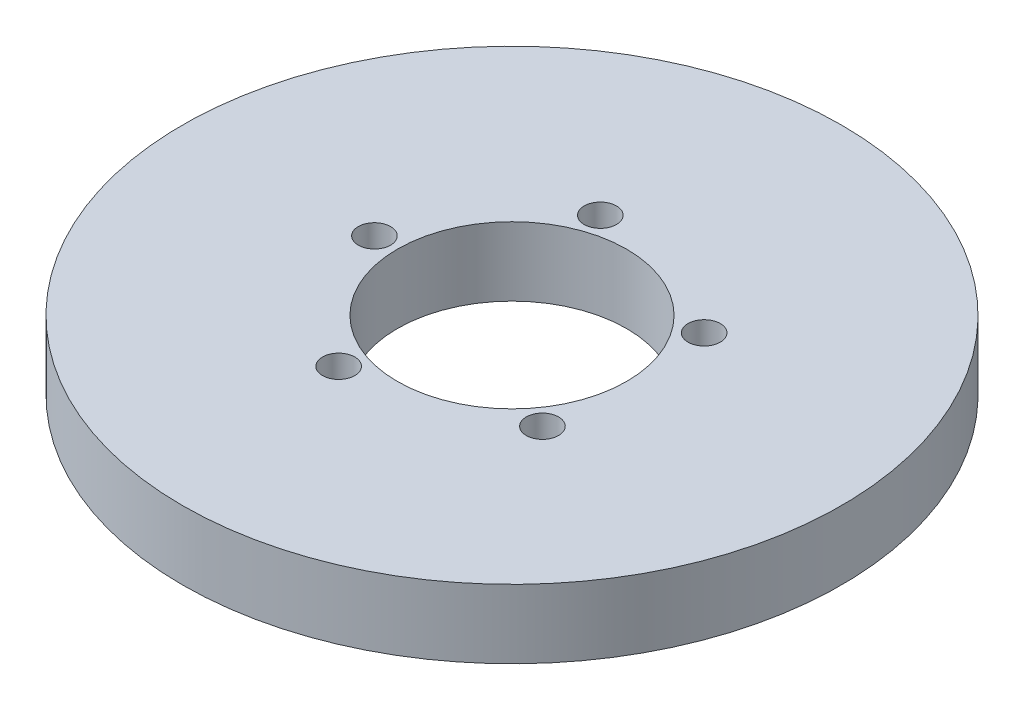
ISO-10303-21;
HEADER;
FILE_DESCRIPTION(('STEP AP214'),'2;1');
FILE_NAME('part.step','',(''),(''),'','','');
FILE_SCHEMA(('AUTOMOTIVE_DESIGN { 1 0 10303 214 1 1 1 1 }'));
ENDSEC;
DATA;
#1=APPLICATION_CONTEXT('core data for automotive mechanical design processes');
#2=APPLICATION_PROTOCOL_DEFINITION('international standard','automotive_design',2000,#1);
#3=PRODUCT_CONTEXT('',#1,'mechanical');
#4=PRODUCT('Part','Part','',(#3));
#5=PRODUCT_RELATED_PRODUCT_CATEGORY('part','',(#4));
#6=PRODUCT_DEFINITION_FORMATION('','',#4);
#7=PRODUCT_DEFINITION_CONTEXT('part definition',#1,'design');
#8=PRODUCT_DEFINITION('design','',#6,#7);
#9=PRODUCT_DEFINITION_SHAPE('','',#8);
#10=(LENGTH_UNIT() NAMED_UNIT(*) SI_UNIT(.MILLI.,.METRE.));
#11=(NAMED_UNIT(*) PLANE_ANGLE_UNIT() SI_UNIT($,.RADIAN.));
#12=(NAMED_UNIT(*) SI_UNIT($,.STERADIAN.) SOLID_ANGLE_UNIT());
#13=UNCERTAINTY_MEASURE_WITH_UNIT(LENGTH_MEASURE(1.E-05),#10,'distance_accuracy_value','');
#14=(GEOMETRIC_REPRESENTATION_CONTEXT(3) GLOBAL_UNCERTAINTY_ASSIGNED_CONTEXT((#13)) GLOBAL_UNIT_ASSIGNED_CONTEXT((#10,
#11,#12)) REPRESENTATION_CONTEXT('',''));
#15=CARTESIAN_POINT('',(0.,0.,0.));
#16=DIRECTION('',(0.,0.,1.));
#17=DIRECTION('',(1.,0.,0.));
#18=AXIS2_PLACEMENT_3D('',#15,#16,#17);
#19=CARTESIAN_POINT('',(0.,12.,0.));
#20=DIRECTION('',(0.,-1.,0.));
#21=DIRECTION('',(0.,0.,-1.));
#22=AXIS2_PLACEMENT_3D('',#19,#20,#21);
#23=CYLINDRICAL_SURFACE('',#22,57.5);
#24=CARTESIAN_POINT('',(0.,12.,0.));
#25=DIRECTION('',(0.,1.,0.));
#26=DIRECTION('',(0.,0.,1.));
#27=AXIS2_PLACEMENT_3D('',#24,#25,#26);
#28=CIRCLE('',#27,57.5);
#29=CARTESIAN_POINT('',(0.,12.,57.5));
#30=VERTEX_POINT('',#29);
#31=EDGE_CURVE('E10',#30,#30,#28,.T.);
#32=ORIENTED_EDGE('',*,*,#31,.F.);
#33=EDGE_LOOP('',(#32));
#34=FACE_BOUND('',#33,.T.);
#35=CARTESIAN_POINT('',(0.,0.,0.));
#36=DIRECTION('',(0.,1.,0.));
#37=DIRECTION('',(0.,0.,1.));
#38=AXIS2_PLACEMENT_3D('',#35,#36,#37);
#39=CIRCLE('',#38,57.5);
#40=CARTESIAN_POINT('',(0.,0.,57.5));
#41=VERTEX_POINT('',#40);
#42=EDGE_CURVE('E37',#41,#41,#39,.T.);
#43=ORIENTED_EDGE('',*,*,#42,.T.);
#44=EDGE_LOOP('',(#43));
#45=FACE_BOUND('',#44,.T.);
#46=ADVANCED_FACE('F40',(#34,#45),#23,.T.);
#47=CARTESIAN_POINT('',(0.,12.,0.));
#48=DIRECTION('',(0.,1.,0.));
#49=DIRECTION('',(0.,0.,1.));
#50=AXIS2_PLACEMENT_3D('',#47,#48,#49);
#51=PLANE('',#50);
#52=CARTESIAN_POINT('',(-7.41729062574562,12.,22.8280732493018));
#53=DIRECTION('',(0.,1.,0.));
#54=DIRECTION('',(0.951056516295155,0.,0.309016994374945));
#55=AXIS2_PLACEMENT_3D('',#52,#53,#54);
#56=CIRCLE('',#55,2.81764538477282);
#57=CARTESIAN_POINT('',(-4.73755062194846,12.,23.6987735573188));
#58=VERTEX_POINT('',#57);
#59=EDGE_CURVE('E78',#58,#58,#56,.T.);
#60=ORIENTED_EDGE('',*,*,#59,.F.);
#61=EDGE_LOOP('',(#60));
#62=FACE_BOUND('',#61,.T.);
#63=CARTESIAN_POINT('',(19.4187189626382,12.,14.1085251657407));
#64=DIRECTION('',(0.,1.,0.));
#65=DIRECTION('',(0.587785252292469,0.,-0.809016994374951));
#66=AXIS2_PLACEMENT_3D('',#63,#64,#65);
#67=CIRCLE('',#66,2.81764538477282);
#68=CARTESIAN_POINT('',(21.0748893659976,12.,11.8290021653373));
#69=VERTEX_POINT('',#68);
#70=EDGE_CURVE('E71',#69,#69,#67,.T.);
#71=ORIENTED_EDGE('',*,*,#70,.F.);
#72=EDGE_LOOP('',(#71));
#73=FACE_BOUND('',#72,.T.);
#74=CARTESIAN_POINT('',(19.418718962638,12.,-14.1085251657409));
#75=DIRECTION('',(0.,1.,0.));
#76=DIRECTION('',(-0.58778525229248,0.,-0.809016994374942));
#77=AXIS2_PLACEMENT_3D('',#74,#75,#76);
#78=CIRCLE('',#77,2.81764538477282);
#79=CARTESIAN_POINT('',(17.7625485592786,12.,-16.3880481661443));
#80=VERTEX_POINT('',#79);
#81=EDGE_CURVE('E70',#80,#80,#78,.T.);
#82=ORIENTED_EDGE('',*,*,#81,.F.);
#83=EDGE_LOOP('',(#82));
#84=FACE_BOUND('',#83,.T.);
#85=CARTESIAN_POINT('',(-7.41729062574594,12.,-22.8280732493017));
#86=DIRECTION('',(0.,1.,0.));
#87=DIRECTION('',(-0.95105651629515,0.,0.309016994374958));
#88=AXIS2_PLACEMENT_3D('',#85,#86,#87);
#89=CIRCLE('',#88,2.81764538477282);
#90=CARTESIAN_POINT('',(-10.0970306295431,12.,-21.9573729412848));
#91=VERTEX_POINT('',#90);
#92=EDGE_CURVE('E61',#91,#91,#89,.T.);
#93=ORIENTED_EDGE('',*,*,#92,.F.);
#94=EDGE_LOOP('',(#93));
#95=FACE_BOUND('',#94,.T.);
#96=CARTESIAN_POINT('',(-24.002856673785,12.,0.));
#97=DIRECTION('',(0.,1.,0.));
#98=DIRECTION('',(0.,0.,1.));
#99=AXIS2_PLACEMENT_3D('',#96,#97,#98);
#100=CIRCLE('',#99,2.81764538477282);
#101=CARTESIAN_POINT('',(-24.002856673785,12.,2.81764538477282));
#102=VERTEX_POINT('',#101);
#103=EDGE_CURVE('E54',#102,#102,#100,.T.);
#104=ORIENTED_EDGE('',*,*,#103,.F.);
#105=EDGE_LOOP('',(#104));
#106=FACE_BOUND('',#105,.T.);
#107=CARTESIAN_POINT('',(0.,12.,0.));
#108=DIRECTION('',(0.,1.,0.));
#109=DIRECTION('',(0.,0.,1.));
#110=AXIS2_PLACEMENT_3D('',#107,#108,#109);
#111=CIRCLE('',#110,20.);
#112=CARTESIAN_POINT('',(0.,12.,20.));
#113=VERTEX_POINT('',#112);
#114=EDGE_CURVE('E50',#113,#113,#111,.T.);
#115=ORIENTED_EDGE('',*,*,#114,.F.);
#116=EDGE_LOOP('',(#115));
#117=FACE_BOUND('',#116,.T.);
#118=ORIENTED_EDGE('',*,*,#31,.T.);
#119=EDGE_LOOP('',(#118));
#120=FACE_BOUND('',#119,.T.);
#121=ADVANCED_FACE('F94',(#62,#73,#84,#95,#106,#117,#120),#51,.T.);
#122=CARTESIAN_POINT('',(0.,0.,0.));
#123=DIRECTION('',(0.,1.,0.));
#124=DIRECTION('',(0.,0.,1.));
#125=AXIS2_PLACEMENT_3D('',#122,#123,#124);
#126=PLANE('',#125);
#127=CARTESIAN_POINT('',(0.,0.,0.));
#128=DIRECTION('',(0.,1.,0.));
#129=DIRECTION('',(0.,0.,1.));
#130=AXIS2_PLACEMENT_3D('',#127,#128,#129);
#131=CIRCLE('',#130,20.);
#132=CARTESIAN_POINT('',(0.,0.,20.));
#133=VERTEX_POINT('',#132);
#134=EDGE_CURVE('E47',#133,#133,#131,.T.);
#135=ORIENTED_EDGE('',*,*,#134,.T.);
#136=EDGE_LOOP('',(#135));
#137=FACE_BOUND('',#136,.T.);
#138=ORIENTED_EDGE('',*,*,#42,.F.);
#139=EDGE_LOOP('',(#138));
#140=FACE_BOUND('',#139,.T.);
#141=ADVANCED_FACE('F100',(#137,#140),#126,.F.);
#142=CARTESIAN_POINT('',(0.,12.,0.));
#143=DIRECTION('',(0.,-1.,0.));
#144=DIRECTION('',(0.,0.,-1.));
#145=AXIS2_PLACEMENT_3D('',#142,#143,#144);
#146=CYLINDRICAL_SURFACE('',#145,20.);
#147=ORIENTED_EDGE('',*,*,#114,.T.);
#148=EDGE_LOOP('',(#147));
#149=FACE_BOUND('',#148,.T.);
#150=ORIENTED_EDGE('',*,*,#134,.F.);
#151=EDGE_LOOP('',(#150));
#152=FACE_BOUND('',#151,.T.);
#153=ADVANCED_FACE('F108',(#149,#152),#146,.F.);
#154=CARTESIAN_POINT('',(-24.002856673785,1.2060062249373,0.));
#155=DIRECTION('',(0.,1.,0.));
#156=DIRECTION('',(0.,0.,1.));
#157=AXIS2_PLACEMENT_3D('',#154,#155,#156);
#158=CYLINDRICAL_SURFACE('',#157,2.81764538477282);
#159=CARTESIAN_POINT('',(-24.002856673785,1.2060062249373,0.));
#160=DIRECTION('',(0.,1.,0.));
#161=DIRECTION('',(0.,0.,1.));
#162=AXIS2_PLACEMENT_3D('',#159,#160,#161);
#163=CIRCLE('',#162,2.81764538477282);
#164=CARTESIAN_POINT('',(-24.002856673785,1.2060062249373,2.81764538477282));
#165=VERTEX_POINT('',#164);
#166=EDGE_CURVE('E55',#165,#165,#163,.T.);
#167=ORIENTED_EDGE('',*,*,#166,.F.);
#168=EDGE_LOOP('',(#167));
#169=FACE_BOUND('',#168,.T.);
#170=ORIENTED_EDGE('',*,*,#103,.T.);
#171=EDGE_LOOP('',(#170));
#172=FACE_BOUND('',#171,.T.);
#173=ADVANCED_FACE('F115',(#169,#172),#158,.F.);
#174=CARTESIAN_POINT('',(-24.002856673785,1.2060062249373,0.));
#175=DIRECTION('',(0.,1.,0.));
#176=DIRECTION('',(0.,0.,1.));
#177=AXIS2_PLACEMENT_3D('',#174,#175,#176);
#178=PLANE('',#177);
#179=ORIENTED_EDGE('',*,*,#166,.T.);
#180=EDGE_LOOP('',(#179));
#181=FACE_BOUND('',#180,.T.);
#182=ADVANCED_FACE('F142',(#181),#178,.T.);
#183=CARTESIAN_POINT('',(-7.41729062574594,1.2060062249373,-22.8280732493017));
#184=DIRECTION('',(0.,1.,0.));
#185=DIRECTION('',(0.,0.,1.));
#186=AXIS2_PLACEMENT_3D('',#183,#184,#185);
#187=CYLINDRICAL_SURFACE('',#186,2.81764538477282);
#188=CARTESIAN_POINT('',(-7.41729062574594,1.2060062249373,-22.8280732493017));
#189=DIRECTION('',(0.,1.,0.));
#190=DIRECTION('',(-0.95105651629515,0.,0.309016994374958));
#191=AXIS2_PLACEMENT_3D('',#188,#189,#190);
#192=CIRCLE('',#191,2.81764538477282);
#193=CARTESIAN_POINT('',(-10.0970306295431,1.2060062249373,-21.9573729412848));
#194=VERTEX_POINT('',#193);
#195=EDGE_CURVE('E63',#194,#194,#192,.T.);
#196=ORIENTED_EDGE('',*,*,#195,.F.);
#197=EDGE_LOOP('',(#196));
#198=FACE_BOUND('',#197,.T.);
#199=ORIENTED_EDGE('',*,*,#92,.T.);
#200=EDGE_LOOP('',(#199));
#201=FACE_BOUND('',#200,.T.);
#202=ADVANCED_FACE('F147',(#198,#201),#187,.F.);
#203=CARTESIAN_POINT('',(-7.41729062574594,1.2060062249373,-22.8280732493017));
#204=DIRECTION('',(0.,1.,0.));
#205=DIRECTION('',(-0.95105651629515,0.,0.309016994374958));
#206=AXIS2_PLACEMENT_3D('',#203,#204,#205);
#207=PLANE('',#206);
#208=ORIENTED_EDGE('',*,*,#195,.T.);
#209=EDGE_LOOP('',(#208));
#210=FACE_BOUND('',#209,.T.);
#211=ADVANCED_FACE('F163',(#210),#207,.T.);
#212=CARTESIAN_POINT('',(19.418718962638,1.2060062249373,-14.1085251657409));
#213=DIRECTION('',(0.,1.,0.));
#214=DIRECTION('',(0.,0.,1.));
#215=AXIS2_PLACEMENT_3D('',#212,#213,#214);
#216=CYLINDRICAL_SURFACE('',#215,2.81764538477282);
#217=CARTESIAN_POINT('',(19.418718962638,1.2060062249373,-14.1085251657409));
#218=DIRECTION('',(0.,1.,0.));
#219=DIRECTION('',(-0.58778525229248,0.,-0.809016994374942));
#220=AXIS2_PLACEMENT_3D('',#217,#218,#219);
#221=CIRCLE('',#220,2.81764538477282);
#222=CARTESIAN_POINT('',(17.7625485592786,1.2060062249373,-16.3880481661443));
#223=VERTEX_POINT('',#222);
#224=EDGE_CURVE('E69',#223,#223,#221,.T.);
#225=ORIENTED_EDGE('',*,*,#224,.F.);
#226=EDGE_LOOP('',(#225));
#227=FACE_BOUND('',#226,.T.);
#228=ORIENTED_EDGE('',*,*,#81,.T.);
#229=EDGE_LOOP('',(#228));
#230=FACE_BOUND('',#229,.T.);
#231=ADVANCED_FACE('F172',(#227,#230),#216,.F.);
#232=CARTESIAN_POINT('',(19.418718962638,1.2060062249373,-14.1085251657409));
#233=DIRECTION('',(0.,1.,0.));
#234=DIRECTION('',(-0.58778525229248,0.,-0.809016994374942));
#235=AXIS2_PLACEMENT_3D('',#232,#233,#234);
#236=PLANE('',#235);
#237=ORIENTED_EDGE('',*,*,#224,.T.);
#238=EDGE_LOOP('',(#237));
#239=FACE_BOUND('',#238,.T.);
#240=ADVANCED_FACE('F185',(#239),#236,.T.);
#241=CARTESIAN_POINT('',(19.4187189626382,1.2060062249373,14.1085251657407));
#242=DIRECTION('',(0.,1.,0.));
#243=DIRECTION('',(0.,0.,1.));
#244=AXIS2_PLACEMENT_3D('',#241,#242,#243);
#245=CYLINDRICAL_SURFACE('',#244,2.81764538477282);
#246=CARTESIAN_POINT('',(19.4187189626382,1.2060062249373,14.1085251657407));
#247=DIRECTION('',(0.,1.,0.));
#248=DIRECTION('',(0.587785252292469,0.,-0.809016994374951));
#249=AXIS2_PLACEMENT_3D('',#246,#247,#248);
#250=CIRCLE('',#249,2.81764538477282);
#251=CARTESIAN_POINT('',(21.0748893659976,1.2060062249373,11.8290021653373));
#252=VERTEX_POINT('',#251);
#253=EDGE_CURVE('E76',#252,#252,#250,.T.);
#254=ORIENTED_EDGE('',*,*,#253,.F.);
#255=EDGE_LOOP('',(#254));
#256=FACE_BOUND('',#255,.T.);
#257=ORIENTED_EDGE('',*,*,#70,.T.);
#258=EDGE_LOOP('',(#257));
#259=FACE_BOUND('',#258,.T.);
#260=ADVANCED_FACE('F191',(#256,#259),#245,.F.);
#261=CARTESIAN_POINT('',(19.4187189626382,1.2060062249373,14.1085251657407));
#262=DIRECTION('',(0.,1.,0.));
#263=DIRECTION('',(0.587785252292469,0.,-0.809016994374951));
#264=AXIS2_PLACEMENT_3D('',#261,#262,#263);
#265=PLANE('',#264);
#266=ORIENTED_EDGE('',*,*,#253,.T.);
#267=EDGE_LOOP('',(#266));
#268=FACE_BOUND('',#267,.T.);
#269=ADVANCED_FACE('F89',(#268),#265,.T.);
#270=CARTESIAN_POINT('',(-7.41729062574562,1.2060062249373,22.8280732493018));
#271=DIRECTION('',(0.,1.,0.));
#272=DIRECTION('',(0.,0.,1.));
#273=AXIS2_PLACEMENT_3D('',#270,#271,#272);
#274=CYLINDRICAL_SURFACE('',#273,2.81764538477282);
#275=CARTESIAN_POINT('',(-7.41729062574562,1.2060062249373,22.8280732493018));
#276=DIRECTION('',(0.,1.,0.));
#277=DIRECTION('',(0.951056516295155,0.,0.309016994374945));
#278=AXIS2_PLACEMENT_3D('',#275,#276,#277);
#279=CIRCLE('',#278,2.81764538477282);
#280=CARTESIAN_POINT('',(-4.73755062194846,1.2060062249373,23.6987735573188));
#281=VERTEX_POINT('',#280);
#282=EDGE_CURVE('E59',#281,#281,#279,.T.);
#283=ORIENTED_EDGE('',*,*,#282,.F.);
#284=EDGE_LOOP('',(#283));
#285=FACE_BOUND('',#284,.T.);
#286=ORIENTED_EDGE('',*,*,#59,.T.);
#287=EDGE_LOOP('',(#286));
#288=FACE_BOUND('',#287,.T.);
#289=ADVANCED_FACE('F87',(#285,#288),#274,.F.);
#290=CARTESIAN_POINT('',(-7.41729062574562,1.2060062249373,22.8280732493018));
#291=DIRECTION('',(0.,1.,0.));
#292=DIRECTION('',(0.951056516295155,0.,0.309016994374945));
#293=AXIS2_PLACEMENT_3D('',#290,#291,#292);
#294=PLANE('',#293);
#295=ORIENTED_EDGE('',*,*,#282,.T.);
#296=EDGE_LOOP('',(#295));
#297=FACE_BOUND('',#296,.T.);
#298=ADVANCED_FACE('F84',(#297),#294,.T.);
#299=CLOSED_SHELL('',(#46,#121,#141,#153,#173,#182,#202,#211,#231,#240,#260,#269,#289,#298));
#300=MANIFOLD_SOLID_BREP('B2',#299);
#301=ADVANCED_BREP_SHAPE_REPRESENTATION('',(#18,#300),#14);
#302=SHAPE_DEFINITION_REPRESENTATION(#9,#301);
ENDSEC;
END-ISO-10303-21;
